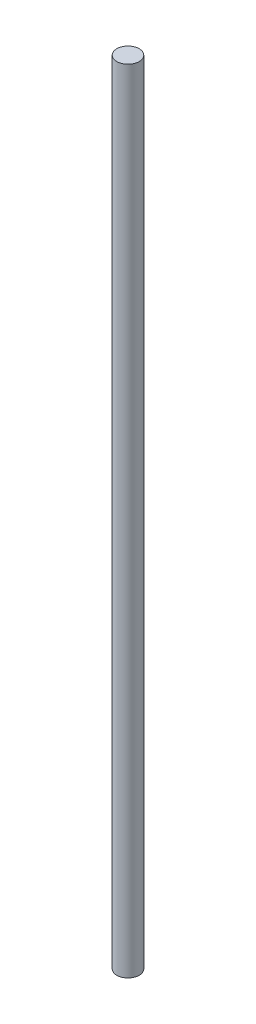
ISO-10303-21;
HEADER;
FILE_DESCRIPTION(('STEP AP214'),'2;1');
FILE_NAME('part.step','',(''),(''),'','','');
FILE_SCHEMA(('AUTOMOTIVE_DESIGN { 1 0 10303 214 1 1 1 1 }'));
ENDSEC;
DATA;
#1=APPLICATION_CONTEXT('core data for automotive mechanical design processes');
#2=APPLICATION_PROTOCOL_DEFINITION('international standard','automotive_design',2000,#1);
#3=PRODUCT_CONTEXT('',#1,'mechanical');
#4=PRODUCT('Part','Part','',(#3));
#5=PRODUCT_RELATED_PRODUCT_CATEGORY('part','',(#4));
#6=PRODUCT_DEFINITION_FORMATION('','',#4);
#7=PRODUCT_DEFINITION_CONTEXT('part definition',#1,'design');
#8=PRODUCT_DEFINITION('design','',#6,#7);
#9=PRODUCT_DEFINITION_SHAPE('','',#8);
#10=(LENGTH_UNIT() NAMED_UNIT(*) SI_UNIT(.MILLI.,.METRE.));
#11=(NAMED_UNIT(*) PLANE_ANGLE_UNIT() SI_UNIT($,.RADIAN.));
#12=(NAMED_UNIT(*) SI_UNIT($,.STERADIAN.) SOLID_ANGLE_UNIT());
#13=UNCERTAINTY_MEASURE_WITH_UNIT(LENGTH_MEASURE(1.E-05),#10,'distance_accuracy_value','');
#14=(GEOMETRIC_REPRESENTATION_CONTEXT(3) GLOBAL_UNCERTAINTY_ASSIGNED_CONTEXT((#13)) GLOBAL_UNIT_ASSIGNED_CONTEXT((#10,
#11,#12)) REPRESENTATION_CONTEXT('',''));
#15=CARTESIAN_POINT('',(0.,0.,0.));
#16=DIRECTION('',(0.,0.,1.));
#17=DIRECTION('',(1.,0.,0.));
#18=AXIS2_PLACEMENT_3D('',#15,#16,#17);
#19=CARTESIAN_POINT('',(0.,450.,0.));
#20=DIRECTION('',(0.,-1.,0.));
#21=DIRECTION('',(0.,0.,-1.));
#22=AXIS2_PLACEMENT_3D('',#19,#20,#21);
#23=CYLINDRICAL_SURFACE('',#22,6.35);
#24=CARTESIAN_POINT('',(0.,450.,0.));
#25=DIRECTION('',(0.,1.,0.));
#26=DIRECTION('',(0.,0.,1.));
#27=AXIS2_PLACEMENT_3D('',#24,#25,#26);
#28=CIRCLE('',#27,6.35);
#29=CARTESIAN_POINT('',(0.,450.,6.35));
#30=VERTEX_POINT('',#29);
#31=EDGE_CURVE('E10',#30,#30,#28,.T.);
#32=ORIENTED_EDGE('',*,*,#31,.F.);
#33=EDGE_LOOP('',(#32));
#34=FACE_BOUND('',#33,.T.);
#35=CARTESIAN_POINT('',(0.,0.,0.));
#36=DIRECTION('',(0.,1.,0.));
#37=DIRECTION('',(0.,0.,1.));
#38=AXIS2_PLACEMENT_3D('',#35,#36,#37);
#39=CIRCLE('',#38,6.35);
#40=CARTESIAN_POINT('',(0.,0.,6.35));
#41=VERTEX_POINT('',#40);
#42=EDGE_CURVE('E44',#41,#41,#39,.T.);
#43=ORIENTED_EDGE('',*,*,#42,.T.);
#44=EDGE_LOOP('',(#43));
#45=FACE_BOUND('',#44,.T.);
#46=ADVANCED_FACE('F41',(#34,#45),#23,.T.);
#47=CARTESIAN_POINT('',(0.,450.,0.));
#48=DIRECTION('',(0.,1.,0.));
#49=DIRECTION('',(0.,0.,1.));
#50=AXIS2_PLACEMENT_3D('',#47,#48,#49);
#51=PLANE('',#50);
#52=ORIENTED_EDGE('',*,*,#31,.T.);
#53=EDGE_LOOP('',(#52));
#54=FACE_BOUND('',#53,.T.);
#55=ADVANCED_FACE('F56',(#54),#51,.T.);
#56=CARTESIAN_POINT('',(0.,0.,0.));
#57=DIRECTION('',(0.,1.,0.));
#58=DIRECTION('',(0.,0.,1.));
#59=AXIS2_PLACEMENT_3D('',#56,#57,#58);
#60=PLANE('',#59);
#61=ORIENTED_EDGE('',*,*,#42,.F.);
#62=EDGE_LOOP('',(#61));
#63=FACE_BOUND('',#62,.T.);
#64=ADVANCED_FACE('F54',(#63),#60,.F.);
#65=CLOSED_SHELL('',(#46,#55,#64));
#66=MANIFOLD_SOLID_BREP('B2',#65);
#67=ADVANCED_BREP_SHAPE_REPRESENTATION('',(#18,#66),#14);
#68=SHAPE_DEFINITION_REPRESENTATION(#9,#67);
ENDSEC;
END-ISO-10303-21;
